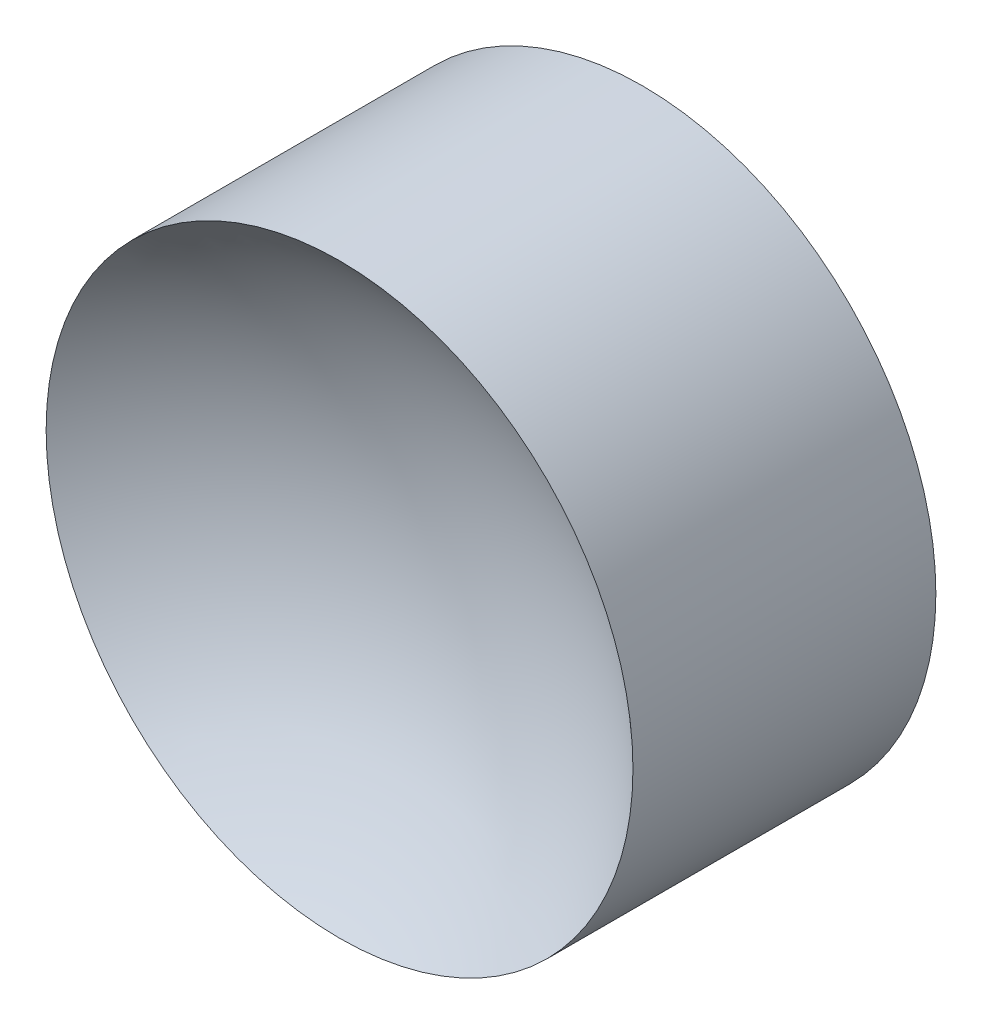
ISO-10303-21;
HEADER;
FILE_DESCRIPTION(('STEP AP214'),'2;1');
FILE_NAME('part.step','',(''),(''),'','','');
FILE_SCHEMA(('AUTOMOTIVE_DESIGN { 1 0 10303 214 1 1 1 1 }'));
ENDSEC;
DATA;
#1=APPLICATION_CONTEXT('core data for automotive mechanical design processes');
#2=APPLICATION_PROTOCOL_DEFINITION('international standard','automotive_design',2000,#1);
#3=PRODUCT_CONTEXT('',#1,'mechanical');
#4=PRODUCT('Part','Part','',(#3));
#5=PRODUCT_RELATED_PRODUCT_CATEGORY('part','',(#4));
#6=PRODUCT_DEFINITION_FORMATION('','',#4);
#7=PRODUCT_DEFINITION_CONTEXT('part definition',#1,'design');
#8=PRODUCT_DEFINITION('design','',#6,#7);
#9=PRODUCT_DEFINITION_SHAPE('','',#8);
#10=(LENGTH_UNIT() NAMED_UNIT(*) SI_UNIT(.MILLI.,.METRE.));
#11=(NAMED_UNIT(*) PLANE_ANGLE_UNIT() SI_UNIT($,.RADIAN.));
#12=(NAMED_UNIT(*) SI_UNIT($,.STERADIAN.) SOLID_ANGLE_UNIT());
#13=UNCERTAINTY_MEASURE_WITH_UNIT(LENGTH_MEASURE(1.E-05),#10,'distance_accuracy_value','');
#14=(GEOMETRIC_REPRESENTATION_CONTEXT(3) GLOBAL_UNCERTAINTY_ASSIGNED_CONTEXT((#13)) GLOBAL_UNIT_ASSIGNED_CONTEXT((#10,
#11,#12)) REPRESENTATION_CONTEXT('',''));
#15=CARTESIAN_POINT('',(0.,0.,0.));
#16=DIRECTION('',(0.,0.,1.));
#17=DIRECTION('',(1.,0.,0.));
#18=AXIS2_PLACEMENT_3D('',#15,#16,#17);
#19=CARTESIAN_POINT('',(0.,0.,-4.54999999999999));
#20=DIRECTION('',(0.,1.,0.));
#21=DIRECTION('',(0.,0.,1.));
#22=AXIS2_PLACEMENT_3D('',#19,#20,#21);
#23=SPHERICAL_SURFACE('',#22,4.55);
#24=CARTESIAN_POINT('',(-2.82500000000002,0.,-0.983226247713491));
#25=CARTESIAN_POINT('',(-2.82499296336149,0.158681498555381,-0.983226247713484));
#26=CARTESIAN_POINT('',(-2.81158532347101,0.317478056151265,-0.98322624771346));
#27=CARTESIAN_POINT('',(-2.75828564640284,0.630697814096677,-0.98322624771352));
#28=CARTESIAN_POINT('',(-2.718361733991,0.785115517389592,-0.983226247713603));
#29=CARTESIAN_POINT('',(-2.61316605316133,1.08499449849476,-0.983226247713586));
#30=CARTESIAN_POINT('',(-2.54790639065292,1.2304600154342,-0.983226247713485));
#31=CARTESIAN_POINT('',(-2.39390832058261,1.50832938123646,-0.983226247713495));
#32=CARTESIAN_POINT('',(-2.30517575115974,1.64073646674262,-0.983226247713606));
#33=CARTESIAN_POINT('',(-2.10673274266052,1.88879090135446,-0.983226247713622));
#34=CARTESIAN_POINT('',(-1.99702010941483,2.00443649525822,-0.983226247713525));
#35=CARTESIAN_POINT('',(-1.75973246848773,2.21567133138496,-0.983226247713455));
#36=CARTESIAN_POINT('',(-1.6321567596825,2.31125978599923,-0.983226247713481));
#37=CARTESIAN_POINT('',(-1.36277043542141,2.47965986434355,-0.983226247713499));
#38=CARTESIAN_POINT('',(-1.22096008512488,2.55247191224283,-0.983226247713492));
#39=CARTESIAN_POINT('',(-0.927128359982412,2.67325445181383,-0.983226247713488));
#40=CARTESIAN_POINT('',(-0.775107005669444,2.72122499343683,-0.98322624771349));
#41=CARTESIAN_POINT('',(-0.465168156414572,2.79096309500118,-0.983226247713491));
#42=CARTESIAN_POINT('',(-0.307250650233069,2.81273060499009,-0.98322624771349));
#43=CARTESIAN_POINT('',(0.00999712060712707,2.82944453755249,-0.98322624771349));
#44=CARTESIAN_POINT('',(0.169327382719658,2.82439100845481,-0.98322624771349));
#45=CARTESIAN_POINT('',(0.484878097050551,2.78760642474479,-0.98322624771349));
#46=CARTESIAN_POINT('',(0.641098548108475,2.75587536017783,-0.98322624771349));
#47=CARTESIAN_POINT('',(0.945995105563209,2.66663639494778,-0.98322624771349));
#48=CARTESIAN_POINT('',(1.09467120399596,2.60912846707447,-0.98322624771349));
#49=CARTESIAN_POINT('',(1.38025835027944,2.46996827362406,-0.98322624771349));
#50=CARTESIAN_POINT('',(1.51716940195873,2.38831601590405,-0.98322624771349));
#51=CARTESIAN_POINT('',(1.77533995302147,2.20318506188829,-0.98322624771349));
#52=CARTESIAN_POINT('',(1.89659945874011,2.09970637442717,-0.983226247713491));
#53=CARTESIAN_POINT('',(2.120024798896,1.87385997999168,-0.983226247713489));
#54=CARTESIAN_POINT('',(2.22219063071663,1.75149227042872,-0.983226247713486));
#55=CARTESIAN_POINT('',(2.40452842714589,1.4913414841156,-0.983226247713494));
#56=CARTESIAN_POINT('',(2.48470038888029,1.35355840535091,-0.983226247713504));
#57=CARTESIAN_POINT('',(2.62077457793986,1.06648815684021,-0.983226247713473));
#58=CARTESIAN_POINT('',(2.67667680630418,0.917200987586769,-0.983226247713433));
#59=CARTESIAN_POINT('',(2.76262463173384,0.611360383820327,-0.983226247713546));
#60=CARTESIAN_POINT('',(2.79267022996405,0.454806949634682,-0.9832262477137));
#61=CARTESIAN_POINT('',(2.82605189324351,0.1388779012594,-0.983226247713682));
#62=CARTESIAN_POINT('',(2.82938795829274,-0.0204977129302366,-0.983226247713511));
#63=CARTESIAN_POINT('',(2.80925585367732,-0.337546923577568,-0.983226247713469));
#64=CARTESIAN_POINT('',(2.78578768280512,-0.495220519958585,-0.983226247713598));
#65=CARTESIAN_POINT('',(2.71271329519498,-0.804389804305576,-0.983226247713611));
#66=CARTESIAN_POINT('',(2.66310707733792,-0.955885492007036,-0.983226247713495));
#67=CARTESIAN_POINT('',(2.53916477807325,-1.24839841493355,-0.983226247713485));
#68=CARTESIAN_POINT('',(2.46482869989741,-1.38941565152795,-0.983226247713592));
#69=CARTESIAN_POINT('',(2.29353687262107,-1.65696861154077,-0.983226247713611));
#70=CARTESIAN_POINT('',(2.19658112662039,-1.78350433694376,-0.983226247713522));
#71=CARTESIAN_POINT('',(1.98280220214468,-2.01850236889474,-0.983226247713458));
#72=CARTESIAN_POINT('',(1.86597901562799,-2.12696466812721,-0.983226247713481));
#73=CARTESIAN_POINT('',(1.61578146449902,-2.32273689029511,-0.983226247713499));
#74=CARTESIAN_POINT('',(1.48240709450064,-2.4100468063471,-0.983226247713492));
#75=CARTESIAN_POINT('',(1.2028934648412,-2.56103566188844,-0.983226247713488));
#76=CARTESIAN_POINT('',(1.05675421865502,-2.62471462632276,-0.983226247713489));
#77=CARTESIAN_POINT('',(0.755859231449713,-2.72663403364136,-0.983226247713491));
#78=CARTESIAN_POINT('',(0.601103493645827,-2.76487448601791,-0.98322624771349));
#79=CARTESIAN_POINT('',(0.287368241269818,-2.8148314180828,-0.98322624771349));
#80=CARTESIAN_POINT('',(0.128388719087362,-2.82654784997739,-0.98322624771349));
#81=CARTESIAN_POINT('',(-0.189280559317742,-2.82312401516609,-0.98322624771349));
#82=CARTESIAN_POINT('',(-0.347970316092207,-2.80798379965854,-0.98322624771349));
#83=CARTESIAN_POINT('',(-0.660555957829449,-2.75127647081001,-0.98322624771349));
#84=CARTESIAN_POINT('',(-0.814451833152009,-2.70970930432957,-0.98322624771349));
#85=CARTESIAN_POINT('',(-1.11308350057999,-2.60132708579508,-0.98322624771349));
#86=CARTESIAN_POINT('',(-1.25781912202877,-2.53451156352265,-0.98322624771349));
#87=CARTESIAN_POINT('',(-1.53401297909065,-2.37753215770293,-0.98322624771349));
#88=CARTESIAN_POINT('',(-1.66547173574236,-2.28736919090036,-0.98322624771349));
#89=CARTESIAN_POINT('',(-1.91137368829528,-2.08626508879529,-0.98322624771349));
#90=CARTESIAN_POINT('',(-2.02581866309285,-1.97532612849638,-0.98322624771349));
#91=CARTESIAN_POINT('',(-2.23448816380219,-1.73577690701896,-0.98322624771349));
#92=CARTESIAN_POINT('',(-2.3287076569225,-1.60716226055394,-0.983226247713488));
#93=CARTESIAN_POINT('',(-2.49425224051658,-1.33589020999111,-0.983226247713489));
#94=CARTESIAN_POINT('',(-2.56556637834517,-1.19322613035544,-0.98322624771349));
#95=CARTESIAN_POINT('',(-2.68314903933774,-0.898062124797752,-0.98322624771349));
#96=CARTESIAN_POINT('',(-2.7294475850234,-0.745574236166782,-0.983226247713488));
#97=CARTESIAN_POINT('',(-2.78334521879968,-0.493428780079135,-0.983226247713488));
#98=CARTESIAN_POINT('',(-2.79894626700446,-0.395409597466019,-0.983226247713488));
#99=CARTESIAN_POINT('',(-2.81977585620286,-0.198275253427874,-0.983226247713491));
#100=CARTESIAN_POINT('',(-2.82500439719648,-0.0991600920028438,-0.983226247713495));
#101=CARTESIAN_POINT('',(-2.82500000000002,0.,-0.983226247713491));
#102=B_SPLINE_CURVE_WITH_KNOTS('',3,(#24,#25,#26,#27,#28,#29,#30,#31,#32,#33,#34,#35,#36,#37,
#38,#39,#40,#41,#42,#43,#44,#45,#46,#47,#48,#49,#50,#51,#52,#53,#54,#55,#56,#57,#58,#59,#60,#61,
#62,#63,#64,#65,#66,#67,#68,#69,#70,#71,#72,#73,#74,#75,#76,#77,#78,#79,#80,#81,#82,#83,#84,#85,
#86,#87,#88,#89,#90,#91,#92,#93,#94,#95,#96,#97,#98,#99,#100,#101),.UNSPECIFIED.,.T.,.F.,(4,2,2,
2,2,2,2,2,2,2,2,2,2,2,2,2,2,2,2,2,2,2,2,2,2,2,2,2,2,2,2,2,2,2,2,2,2,2,4),(0.,0.4756825615378,
0.951937978954745,1.42796611188273,1.90387595908897,2.37983560587916,2.85581393927442,
3.33178340790932,3.80775191946117,4.28372133837911,4.75968989964792,5.23565863852278,
5.71162787983466,6.18759696625615,6.66356586002141,7.13953481901421,7.61550384020816,
8.09147284102293,8.56744182039484,9.04341079976682,9.51937980058166,9.99534882177563,
10.4713177807684,10.9472866745337,11.4232557609552,11.8992250022671,12.3751937411419,
12.8511623024107,13.3271317213287,13.8031002328805,14.2790697015154,14.7550480349107,
15.2310076817009,15.7069175289071,16.1829456618351,16.6592010792521,17.1348836407899,
17.4321377441079,17.7293918474259),.UNSPECIFIED.);
#103=CARTESIAN_POINT('',(-2.82500000000002,0.,-0.983226247713491));
#104=VERTEX_POINT('',#103);
#105=EDGE_CURVE('E19',#104,#104,#102,.F.);
#106=ORIENTED_EDGE('',*,*,#105,.F.);
#107=EDGE_LOOP('',(#106));
#108=FACE_BOUND('',#107,.T.);
#109=ADVANCED_FACE('F14',(#108),#23,.F.);
#110=CARTESIAN_POINT('',(0.,0.,5.55));
#111=DIRECTION('',(0.,1.,0.));
#112=DIRECTION('',(0.,0.,-1.));
#113=AXIS2_PLACEMENT_3D('',#110,#111,#112);
#114=SPHERICAL_SURFACE('',#113,4.55);
#115=CARTESIAN_POINT('',(0.,0.,2.24290535363743));
#116=DIRECTION('',(0.,0.,1.));
#117=DIRECTION('',(1.,0.,0.));
#118=AXIS2_PLACEMENT_3D('',#115,#116,#117);
#119=CIRCLE('',#118,3.125);
#120=CARTESIAN_POINT('',(3.125,0.,2.24290535363743));
#121=VERTEX_POINT('',#120);
#122=EDGE_CURVE('E27',#121,#121,#119,.F.);
#123=ORIENTED_EDGE('',*,*,#122,.F.);
#124=EDGE_LOOP('',(#123));
#125=FACE_BOUND('',#124,.T.);
#126=ADVANCED_FACE('F35',(#125),#114,.F.);
#127=CARTESIAN_POINT('',(0.,0.,-0.98322624771349));
#128=DIRECTION('',(0.,0.,-1.));
#129=DIRECTION('',(-1.,0.,0.));
#130=AXIS2_PLACEMENT_3D('',#127,#128,#129);
#131=PLANE('',#130);
#132=ORIENTED_EDGE('',*,*,#105,.T.);
#133=EDGE_LOOP('',(#132));
#134=FACE_BOUND('',#133,.T.);
#135=CARTESIAN_POINT('',(0.,0.,-0.98322624771349));
#136=DIRECTION('',(0.,0.,1.));
#137=DIRECTION('',(1.,0.,0.));
#138=AXIS2_PLACEMENT_3D('',#135,#136,#137);
#139=CIRCLE('',#138,3.125);
#140=CARTESIAN_POINT('',(3.125,0.,-0.98322624771349));
#141=VERTEX_POINT('',#140);
#142=EDGE_CURVE('E10',#141,#141,#139,.T.);
#143=ORIENTED_EDGE('',*,*,#142,.F.);
#144=EDGE_LOOP('',(#143));
#145=FACE_BOUND('',#144,.T.);
#146=ADVANCED_FACE('F37',(#134,#145),#131,.T.);
#147=CARTESIAN_POINT('',(0.,0.,-0.98322624771349));
#148=DIRECTION('',(0.,0.,1.));
#149=DIRECTION('',(1.,0.,0.));
#150=AXIS2_PLACEMENT_3D('',#147,#148,#149);
#151=CYLINDRICAL_SURFACE('',#150,3.125);
#152=ORIENTED_EDGE('',*,*,#142,.T.);
#153=EDGE_LOOP('',(#152));
#154=FACE_BOUND('',#153,.T.);
#155=ORIENTED_EDGE('',*,*,#122,.T.);
#156=EDGE_LOOP('',(#155));
#157=FACE_BOUND('',#156,.T.);
#158=ADVANCED_FACE('F42',(#154,#157),#151,.T.);
#159=CLOSED_SHELL('',(#109,#126,#146,#158));
#160=MANIFOLD_SOLID_BREP('B1',#159);
#161=ADVANCED_BREP_SHAPE_REPRESENTATION('',(#18,#160),#14);
#162=SHAPE_DEFINITION_REPRESENTATION(#9,#161);
ENDSEC;
END-ISO-10303-21;
